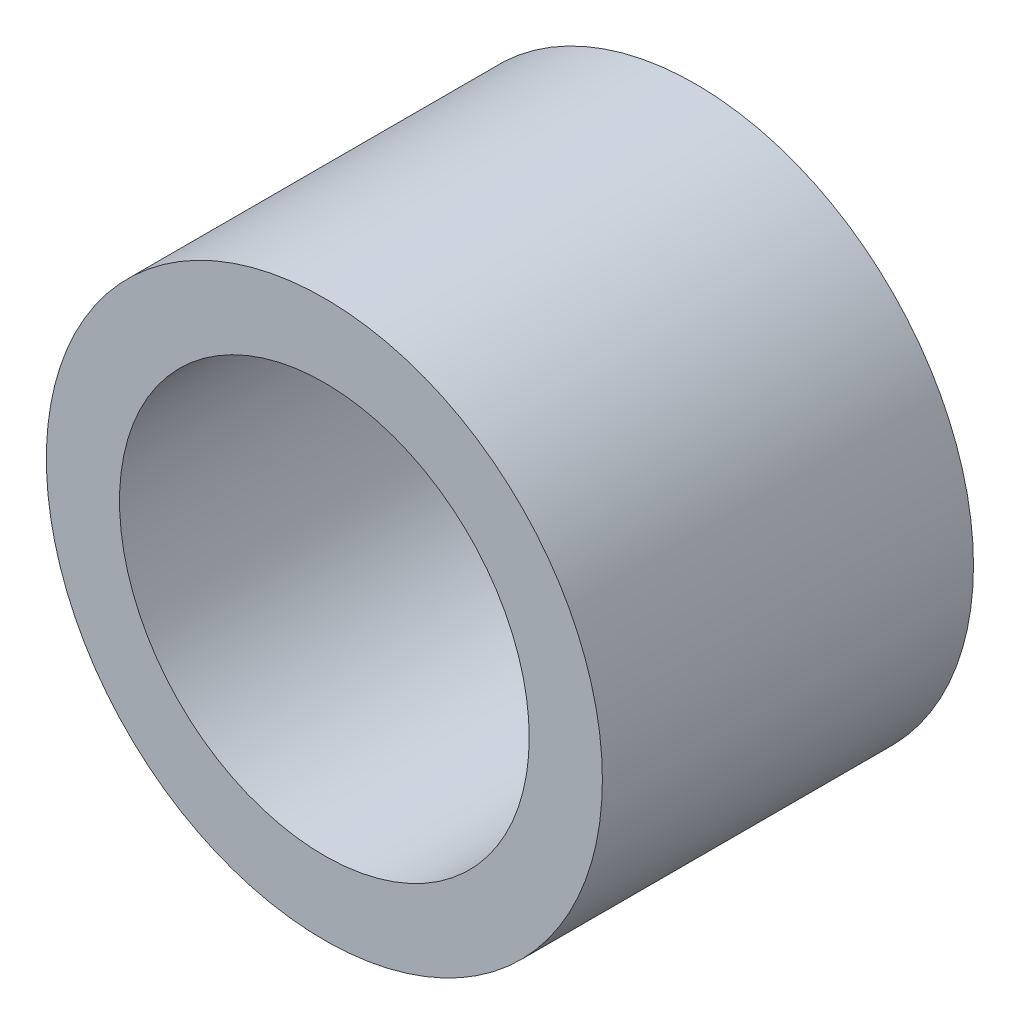
ISO-10303-21;
HEADER;
FILE_DESCRIPTION(('STEP AP214'),'2;1');
FILE_NAME('part.step','',(''),(''),'','','');
FILE_SCHEMA(('AUTOMOTIVE_DESIGN { 1 0 10303 214 1 1 1 1 }'));
ENDSEC;
DATA;
#1=APPLICATION_CONTEXT('core data for automotive mechanical design processes');
#2=APPLICATION_PROTOCOL_DEFINITION('international standard','automotive_design',2000,#1);
#3=PRODUCT_CONTEXT('',#1,'mechanical');
#4=PRODUCT('Part','Part','',(#3));
#5=PRODUCT_RELATED_PRODUCT_CATEGORY('part','',(#4));
#6=PRODUCT_DEFINITION_FORMATION('','',#4);
#7=PRODUCT_DEFINITION_CONTEXT('part definition',#1,'design');
#8=PRODUCT_DEFINITION('design','',#6,#7);
#9=PRODUCT_DEFINITION_SHAPE('','',#8);
#10=(LENGTH_UNIT() NAMED_UNIT(*) SI_UNIT(.MILLI.,.METRE.));
#11=(NAMED_UNIT(*) PLANE_ANGLE_UNIT() SI_UNIT($,.RADIAN.));
#12=(NAMED_UNIT(*) SI_UNIT($,.STERADIAN.) SOLID_ANGLE_UNIT());
#13=UNCERTAINTY_MEASURE_WITH_UNIT(LENGTH_MEASURE(1.E-05),#10,'distance_accuracy_value','');
#14=(GEOMETRIC_REPRESENTATION_CONTEXT(3) GLOBAL_UNCERTAINTY_ASSIGNED_CONTEXT((#13)) GLOBAL_UNIT_ASSIGNED_CONTEXT((#10,
#11,#12)) REPRESENTATION_CONTEXT('',''));
#15=CARTESIAN_POINT('',(0.,0.,0.));
#16=DIRECTION('',(0.,0.,1.));
#17=DIRECTION('',(1.,0.,0.));
#18=AXIS2_PLACEMENT_3D('',#15,#16,#17);
#19=CARTESIAN_POINT('',(0.,0.,6.44144));
#20=DIRECTION('',(0.,0.,1.));
#21=DIRECTION('',(1.,0.,0.));
#22=AXIS2_PLACEMENT_3D('',#19,#20,#21);
#23=PLANE('',#22);
#24=CARTESIAN_POINT('',(0.,0.,6.44144));
#25=DIRECTION('',(0.,0.,1.));
#26=DIRECTION('',(1.,0.,0.));
#27=AXIS2_PLACEMENT_3D('',#24,#25,#26);
#28=CIRCLE('',#27,4.826);
#29=CARTESIAN_POINT('',(4.826,0.,6.44144));
#30=VERTEX_POINT('',#29);
#31=EDGE_CURVE('E10',#30,#30,#28,.T.);
#32=ORIENTED_EDGE('',*,*,#31,.T.);
#33=EDGE_LOOP('',(#32));
#34=FACE_BOUND('',#33,.T.);
#35=CARTESIAN_POINT('',(0.,0.,6.44144));
#36=DIRECTION('',(0.,0.,1.));
#37=DIRECTION('',(1.,0.,0.));
#38=AXIS2_PLACEMENT_3D('',#35,#36,#37);
#39=CIRCLE('',#38,3.556);
#40=CARTESIAN_POINT('',(3.556,0.,6.44144));
#41=VERTEX_POINT('',#40);
#42=EDGE_CURVE('E42',#41,#41,#39,.T.);
#43=ORIENTED_EDGE('',*,*,#42,.F.);
#44=EDGE_LOOP('',(#43));
#45=FACE_BOUND('',#44,.T.);
#46=ADVANCED_FACE('F31',(#34,#45),#23,.T.);
#47=CARTESIAN_POINT('',(0.,0.,0.));
#48=DIRECTION('',(0.,0.,1.));
#49=DIRECTION('',(1.,0.,0.));
#50=AXIS2_PLACEMENT_3D('',#47,#48,#49);
#51=PLANE('',#50);
#52=CARTESIAN_POINT('',(0.,0.,0.));
#53=DIRECTION('',(0.,0.,1.));
#54=DIRECTION('',(1.,0.,0.));
#55=AXIS2_PLACEMENT_3D('',#52,#53,#54);
#56=CIRCLE('',#55,4.826);
#57=CARTESIAN_POINT('',(4.826,0.,0.));
#58=VERTEX_POINT('',#57);
#59=EDGE_CURVE('E35',#58,#58,#56,.T.);
#60=ORIENTED_EDGE('',*,*,#59,.F.);
#61=EDGE_LOOP('',(#60));
#62=FACE_BOUND('',#61,.T.);
#63=CARTESIAN_POINT('',(0.,0.,0.));
#64=DIRECTION('',(0.,0.,1.));
#65=DIRECTION('',(1.,0.,0.));
#66=AXIS2_PLACEMENT_3D('',#63,#64,#65);
#67=CIRCLE('',#66,3.556);
#68=CARTESIAN_POINT('',(3.556,0.,0.));
#69=VERTEX_POINT('',#68);
#70=EDGE_CURVE('E44',#69,#69,#67,.T.);
#71=ORIENTED_EDGE('',*,*,#70,.T.);
#72=EDGE_LOOP('',(#71));
#73=FACE_BOUND('',#72,.T.);
#74=ADVANCED_FACE('F54',(#62,#73),#51,.F.);
#75=CARTESIAN_POINT('',(0.,0.,6.44144));
#76=DIRECTION('',(0.,0.,-1.));
#77=DIRECTION('',(-1.,0.,0.));
#78=AXIS2_PLACEMENT_3D('',#75,#76,#77);
#79=CYLINDRICAL_SURFACE('',#78,4.826);
#80=ORIENTED_EDGE('',*,*,#31,.F.);
#81=EDGE_LOOP('',(#80));
#82=FACE_BOUND('',#81,.T.);
#83=ORIENTED_EDGE('',*,*,#59,.T.);
#84=EDGE_LOOP('',(#83));
#85=FACE_BOUND('',#84,.T.);
#86=ADVANCED_FACE('F33',(#82,#85),#79,.T.);
#87=CARTESIAN_POINT('',(0.,0.,6.44144));
#88=DIRECTION('',(0.,0.,-1.));
#89=DIRECTION('',(-1.,0.,0.));
#90=AXIS2_PLACEMENT_3D('',#87,#88,#89);
#91=CYLINDRICAL_SURFACE('',#90,3.556);
#92=ORIENTED_EDGE('',*,*,#42,.T.);
#93=EDGE_LOOP('',(#92));
#94=FACE_BOUND('',#93,.T.);
#95=ORIENTED_EDGE('',*,*,#70,.F.);
#96=EDGE_LOOP('',(#95));
#97=FACE_BOUND('',#96,.T.);
#98=ADVANCED_FACE('F50',(#94,#97),#91,.F.);
#99=CLOSED_SHELL('',(#46,#74,#86,#98));
#100=MANIFOLD_SOLID_BREP('B2',#99);
#101=ADVANCED_BREP_SHAPE_REPRESENTATION('',(#18,#100),#14);
#102=SHAPE_DEFINITION_REPRESENTATION(#9,#101);
ENDSEC;
END-ISO-10303-21;
